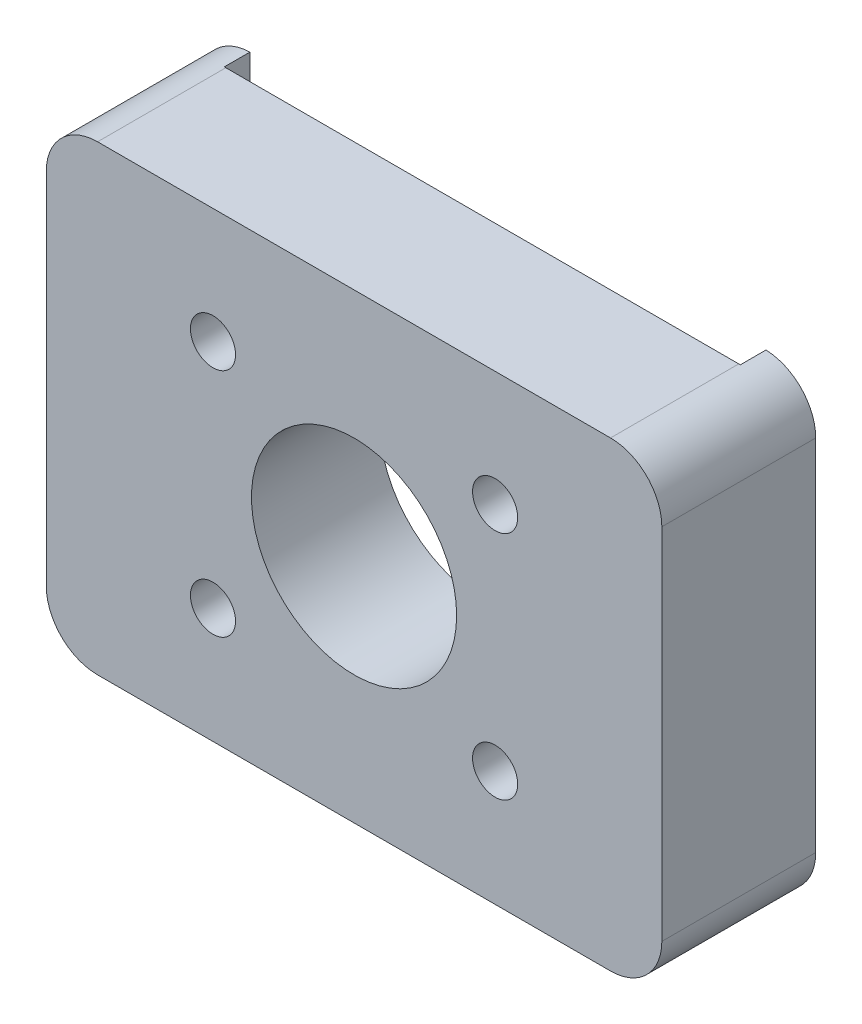
ISO-10303-21;
HEADER;
FILE_DESCRIPTION(('STEP AP214'),'2;1');
FILE_NAME('part.step','',(''),(''),'','','');
FILE_SCHEMA(('AUTOMOTIVE_DESIGN { 1 0 10303 214 1 1 1 1 }'));
ENDSEC;
DATA;
#1=APPLICATION_CONTEXT('core data for automotive mechanical design processes');
#2=APPLICATION_PROTOCOL_DEFINITION('international standard','automotive_design',2000,#1);
#3=PRODUCT_CONTEXT('',#1,'mechanical');
#4=PRODUCT('Part','Part','',(#3));
#5=PRODUCT_RELATED_PRODUCT_CATEGORY('part','',(#4));
#6=PRODUCT_DEFINITION_FORMATION('','',#4);
#7=PRODUCT_DEFINITION_CONTEXT('part definition',#1,'design');
#8=PRODUCT_DEFINITION('design','',#6,#7);
#9=PRODUCT_DEFINITION_SHAPE('','',#8);
#10=(LENGTH_UNIT() NAMED_UNIT(*) SI_UNIT(.MILLI.,.METRE.));
#11=(NAMED_UNIT(*) PLANE_ANGLE_UNIT() SI_UNIT($,.RADIAN.));
#12=(NAMED_UNIT(*) SI_UNIT($,.STERADIAN.) SOLID_ANGLE_UNIT());
#13=UNCERTAINTY_MEASURE_WITH_UNIT(LENGTH_MEASURE(1.E-05),#10,'distance_accuracy_value','');
#14=(GEOMETRIC_REPRESENTATION_CONTEXT(3) GLOBAL_UNCERTAINTY_ASSIGNED_CONTEXT((#13)) GLOBAL_UNIT_ASSIGNED_CONTEXT((#10,
#11,#12)) REPRESENTATION_CONTEXT('',''));
#15=CARTESIAN_POINT('',(0.,0.,0.));
#16=DIRECTION('',(0.,0.,1.));
#17=DIRECTION('',(1.,0.,0.));
#18=AXIS2_PLACEMENT_3D('',#15,#16,#17);
#19=CARTESIAN_POINT('',(-50.,-35.,0.));
#20=DIRECTION('',(0.,0.,1.));
#21=DIRECTION('',(1.,0.,0.));
#22=AXIS2_PLACEMENT_3D('',#19,#20,#21);
#23=PLANE('',#22);
#24=CARTESIAN_POINT('',(-27.5,22.5,0.));
#25=DIRECTION('',(0.,0.,1.));
#26=DIRECTION('',(1.,0.,0.));
#27=AXIS2_PLACEMENT_3D('',#24,#25,#26);
#28=CIRCLE('',#27,4.4);
#29=CARTESIAN_POINT('',(-23.1,22.5,0.));
#30=VERTEX_POINT('',#29);
#31=EDGE_CURVE('E243',#30,#30,#28,.T.);
#32=ORIENTED_EDGE('',*,*,#31,.T.);
#33=EDGE_LOOP('',(#32));
#34=FACE_BOUND('',#33,.T.);
#35=CARTESIAN_POINT('',(27.5,22.5,0.));
#36=DIRECTION('',(0.,0.,1.));
#37=DIRECTION('',(1.,0.,0.));
#38=AXIS2_PLACEMENT_3D('',#35,#36,#37);
#39=CIRCLE('',#38,4.4);
#40=CARTESIAN_POINT('',(31.9,22.5,0.));
#41=VERTEX_POINT('',#40);
#42=EDGE_CURVE('E237',#41,#41,#39,.T.);
#43=ORIENTED_EDGE('',*,*,#42,.T.);
#44=EDGE_LOOP('',(#43));
#45=FACE_BOUND('',#44,.T.);
#46=CARTESIAN_POINT('',(-27.5,-22.5,0.));
#47=DIRECTION('',(0.,0.,1.));
#48=DIRECTION('',(1.,0.,0.));
#49=AXIS2_PLACEMENT_3D('',#46,#47,#48);
#50=CIRCLE('',#49,4.4);
#51=CARTESIAN_POINT('',(-23.1,-22.5,0.));
#52=VERTEX_POINT('',#51);
#53=EDGE_CURVE('E231',#52,#52,#50,.T.);
#54=ORIENTED_EDGE('',*,*,#53,.T.);
#55=EDGE_LOOP('',(#54));
#56=FACE_BOUND('',#55,.T.);
#57=CARTESIAN_POINT('',(27.5,-22.5,0.));
#58=DIRECTION('',(0.,0.,1.));
#59=DIRECTION('',(1.,0.,0.));
#60=AXIS2_PLACEMENT_3D('',#57,#58,#59);
#61=CIRCLE('',#60,4.4);
#62=CARTESIAN_POINT('',(31.9,-22.5,0.));
#63=VERTEX_POINT('',#62);
#64=EDGE_CURVE('E225',#63,#63,#61,.T.);
#65=ORIENTED_EDGE('',*,*,#64,.T.);
#66=EDGE_LOOP('',(#65));
#67=FACE_BOUND('',#66,.T.);
#68=CARTESIAN_POINT('',(0.,0.,0.));
#69=DIRECTION('',(0.,0.,1.));
#70=DIRECTION('',(1.,0.,0.));
#71=AXIS2_PLACEMENT_3D('',#68,#69,#70);
#72=CIRCLE('',#71,20.);
#73=CARTESIAN_POINT('',(20.,0.,0.));
#74=VERTEX_POINT('',#73);
#75=EDGE_CURVE('E221',#74,#74,#72,.T.);
#76=ORIENTED_EDGE('',*,*,#75,.T.);
#77=EDGE_LOOP('',(#76));
#78=FACE_BOUND('',#77,.T.);
#79=DIRECTION('',(0.,-1.,0.));
#80=VECTOR('',#79,1.);
#81=CARTESIAN_POINT('',(-50.3,44.9954989870441,0.));
#82=LINE('',#81,#80);
#83=CARTESIAN_POINT('',(-50.3,44.9954989870441,0.));
#84=VERTEX_POINT('',#83);
#85=CARTESIAN_POINT('',(-50.3,-44.9954989870441,0.));
#86=VERTEX_POINT('',#85);
#87=EDGE_CURVE('E195',#84,#86,#82,.T.);
#88=ORIENTED_EDGE('',*,*,#87,.F.);
#89=CARTESIAN_POINT('',(-50.,35.,0.));
#90=DIRECTION('',(0.,0.,1.));
#91=DIRECTION('',(1.,0.,0.));
#92=AXIS2_PLACEMENT_3D('',#89,#90,#91);
#93=CIRCLE('',#92,10.);
#94=CARTESIAN_POINT('',(-49.9999999999999,45.,0.));
#95=VERTEX_POINT('',#94);
#96=EDGE_CURVE('E145',#95,#84,#93,.T.);
#97=ORIENTED_EDGE('',*,*,#96,.F.);
#98=DIRECTION('',(-1.,0.,0.));
#99=VECTOR('',#98,1.);
#100=CARTESIAN_POINT('',(-49.9999999999999,45.,0.));
#101=LINE('',#100,#99);
#102=CARTESIAN_POINT('',(49.9999999999999,45.,0.));
#103=VERTEX_POINT('',#102);
#104=EDGE_CURVE('E85',#103,#95,#101,.T.);
#105=ORIENTED_EDGE('',*,*,#104,.F.);
#106=CARTESIAN_POINT('',(50.,35.,0.));
#107=DIRECTION('',(0.,0.,1.));
#108=DIRECTION('',(1.,0.,0.));
#109=AXIS2_PLACEMENT_3D('',#106,#107,#108);
#110=CIRCLE('',#109,10.);
#111=CARTESIAN_POINT('',(50.3,44.9954989870441,0.));
#112=VERTEX_POINT('',#111);
#113=EDGE_CURVE('E142',#112,#103,#110,.T.);
#114=ORIENTED_EDGE('',*,*,#113,.F.);
#115=DIRECTION('',(0.,1.,0.));
#116=VECTOR('',#115,1.);
#117=CARTESIAN_POINT('',(50.3,44.9954989870441,0.));
#118=LINE('',#117,#116);
#119=CARTESIAN_POINT('',(50.3,-44.9954989870441,0.));
#120=VERTEX_POINT('',#119);
#121=EDGE_CURVE('E54',#120,#112,#118,.T.);
#122=ORIENTED_EDGE('',*,*,#121,.F.);
#123=CARTESIAN_POINT('',(50.,-35.,0.));
#124=DIRECTION('',(0.,0.,1.));
#125=DIRECTION('',(1.,0.,0.));
#126=AXIS2_PLACEMENT_3D('',#123,#124,#125);
#127=CIRCLE('',#126,10.);
#128=CARTESIAN_POINT('',(49.9999999999999,-45.,0.));
#129=VERTEX_POINT('',#128);
#130=EDGE_CURVE('E140',#129,#120,#127,.T.);
#131=ORIENTED_EDGE('',*,*,#130,.F.);
#132=DIRECTION('',(1.,0.,0.));
#133=VECTOR('',#132,1.);
#134=CARTESIAN_POINT('',(-49.9999999999999,-45.,0.));
#135=LINE('',#134,#133);
#136=CARTESIAN_POINT('',(-49.9999999999999,-45.,0.));
#137=VERTEX_POINT('',#136);
#138=EDGE_CURVE('E137',#137,#129,#135,.T.);
#139=ORIENTED_EDGE('',*,*,#138,.F.);
#140=CARTESIAN_POINT('',(-50.,-35.,0.));
#141=DIRECTION('',(0.,0.,1.));
#142=DIRECTION('',(1.,0.,0.));
#143=AXIS2_PLACEMENT_3D('',#140,#141,#142);
#144=CIRCLE('',#143,9.99999999999999);
#145=EDGE_CURVE('E135',#86,#137,#144,.T.);
#146=ORIENTED_EDGE('',*,*,#145,.F.);
#147=EDGE_LOOP('',(#88,#97,#105,#114,#122,#131,#139,#146));
#148=FACE_BOUND('',#147,.T.);
#149=ADVANCED_FACE('F39',(#34,#45,#56,#67,#78,#148),#23,.F.);
#150=CARTESIAN_POINT('',(-50.,-35.,25.));
#151=DIRECTION('',(0.,0.,1.));
#152=DIRECTION('',(1.,0.,0.));
#153=AXIS2_PLACEMENT_3D('',#150,#151,#152);
#154=PLANE('',#153);
#155=CARTESIAN_POINT('',(27.5,-22.5,25.));
#156=DIRECTION('',(0.,0.,1.));
#157=DIRECTION('',(1.,0.,0.));
#158=AXIS2_PLACEMENT_3D('',#155,#156,#157);
#159=CIRCLE('',#158,4.4);
#160=CARTESIAN_POINT('',(31.9,-22.5,25.));
#161=VERTEX_POINT('',#160);
#162=EDGE_CURVE('E228',#161,#161,#159,.T.);
#163=ORIENTED_EDGE('',*,*,#162,.F.);
#164=EDGE_LOOP('',(#163));
#165=FACE_BOUND('',#164,.T.);
#166=CARTESIAN_POINT('',(27.5,22.5,25.));
#167=DIRECTION('',(0.,0.,1.));
#168=DIRECTION('',(1.,0.,0.));
#169=AXIS2_PLACEMENT_3D('',#166,#167,#168);
#170=CIRCLE('',#169,4.4);
#171=CARTESIAN_POINT('',(31.9,22.5,25.));
#172=VERTEX_POINT('',#171);
#173=EDGE_CURVE('E240',#172,#172,#170,.T.);
#174=ORIENTED_EDGE('',*,*,#173,.F.);
#175=EDGE_LOOP('',(#174));
#176=FACE_BOUND('',#175,.T.);
#177=CARTESIAN_POINT('',(-50.,-35.,25.));
#178=DIRECTION('',(0.,0.,1.));
#179=DIRECTION('',(1.,0.,0.));
#180=AXIS2_PLACEMENT_3D('',#177,#178,#179);
#181=CIRCLE('',#180,9.99999999999999);
#182=CARTESIAN_POINT('',(-60.,-34.9999999999999,25.));
#183=VERTEX_POINT('',#182);
#184=CARTESIAN_POINT('',(-49.9999999999999,-45.,25.));
#185=VERTEX_POINT('',#184);
#186=EDGE_CURVE('E147',#183,#185,#181,.T.);
#187=ORIENTED_EDGE('',*,*,#186,.T.);
#188=DIRECTION('',(1.,0.,0.));
#189=VECTOR('',#188,1.);
#190=CARTESIAN_POINT('',(-49.9999999999999,-45.,25.));
#191=LINE('',#190,#189);
#192=CARTESIAN_POINT('',(49.9999999999999,-45.,25.));
#193=VERTEX_POINT('',#192);
#194=EDGE_CURVE('E93',#185,#193,#191,.T.);
#195=ORIENTED_EDGE('',*,*,#194,.T.);
#196=CARTESIAN_POINT('',(50.,-35.,25.));
#197=DIRECTION('',(0.,0.,1.));
#198=DIRECTION('',(1.,0.,0.));
#199=AXIS2_PLACEMENT_3D('',#196,#197,#198);
#200=CIRCLE('',#199,10.);
#201=CARTESIAN_POINT('',(60.,-34.9999999999999,25.));
#202=VERTEX_POINT('',#201);
#203=EDGE_CURVE('E164',#193,#202,#200,.T.);
#204=ORIENTED_EDGE('',*,*,#203,.T.);
#205=DIRECTION('',(0.,1.,0.));
#206=VECTOR('',#205,1.);
#207=CARTESIAN_POINT('',(60.,34.9999999999999,25.));
#208=LINE('',#207,#206);
#209=CARTESIAN_POINT('',(60.,34.9999999999999,25.));
#210=VERTEX_POINT('',#209);
#211=EDGE_CURVE('E253',#202,#210,#208,.T.);
#212=ORIENTED_EDGE('',*,*,#211,.T.);
#213=CARTESIAN_POINT('',(50.,35.,25.));
#214=DIRECTION('',(0.,0.,1.));
#215=DIRECTION('',(1.,0.,0.));
#216=AXIS2_PLACEMENT_3D('',#213,#214,#215);
#217=CIRCLE('',#216,10.);
#218=CARTESIAN_POINT('',(49.9999999999999,45.,25.));
#219=VERTEX_POINT('',#218);
#220=EDGE_CURVE('E116',#210,#219,#217,.T.);
#221=ORIENTED_EDGE('',*,*,#220,.T.);
#222=DIRECTION('',(-1.,0.,0.));
#223=VECTOR('',#222,1.);
#224=CARTESIAN_POINT('',(-49.9999999999999,45.,25.));
#225=LINE('',#224,#223);
#226=CARTESIAN_POINT('',(-49.9999999999999,45.,25.));
#227=VERTEX_POINT('',#226);
#228=EDGE_CURVE('E109',#219,#227,#225,.T.);
#229=ORIENTED_EDGE('',*,*,#228,.T.);
#230=CARTESIAN_POINT('',(-50.,35.,25.));
#231=DIRECTION('',(0.,0.,1.));
#232=DIRECTION('',(1.,0.,0.));
#233=AXIS2_PLACEMENT_3D('',#230,#231,#232);
#234=CIRCLE('',#233,10.);
#235=CARTESIAN_POINT('',(-60.,34.9999999999999,25.));
#236=VERTEX_POINT('',#235);
#237=EDGE_CURVE('E113',#227,#236,#234,.T.);
#238=ORIENTED_EDGE('',*,*,#237,.T.);
#239=DIRECTION('',(0.,-1.,0.));
#240=VECTOR('',#239,1.);
#241=CARTESIAN_POINT('',(-60.,34.9999999999999,25.));
#242=LINE('',#241,#240);
#243=EDGE_CURVE('E63',#236,#183,#242,.T.);
#244=ORIENTED_EDGE('',*,*,#243,.T.);
#245=EDGE_LOOP('',(#187,#195,#204,#212,#221,#229,#238,#244));
#246=FACE_BOUND('',#245,.T.);
#247=CARTESIAN_POINT('',(-27.5,22.5,25.));
#248=DIRECTION('',(0.,0.,1.));
#249=DIRECTION('',(1.,0.,0.));
#250=AXIS2_PLACEMENT_3D('',#247,#248,#249);
#251=CIRCLE('',#250,4.4);
#252=CARTESIAN_POINT('',(-23.1,22.5,25.));
#253=VERTEX_POINT('',#252);
#254=EDGE_CURVE('E138',#253,#253,#251,.T.);
#255=ORIENTED_EDGE('',*,*,#254,.F.);
#256=EDGE_LOOP('',(#255));
#257=FACE_BOUND('',#256,.T.);
#258=CARTESIAN_POINT('',(-27.5,-22.5,25.));
#259=DIRECTION('',(0.,0.,1.));
#260=DIRECTION('',(1.,0.,0.));
#261=AXIS2_PLACEMENT_3D('',#258,#259,#260);
#262=CIRCLE('',#261,4.4);
#263=CARTESIAN_POINT('',(-23.1,-22.5,25.));
#264=VERTEX_POINT('',#263);
#265=EDGE_CURVE('E234',#264,#264,#262,.T.);
#266=ORIENTED_EDGE('',*,*,#265,.F.);
#267=EDGE_LOOP('',(#266));
#268=FACE_BOUND('',#267,.T.);
#269=CARTESIAN_POINT('',(0.,0.,25.));
#270=DIRECTION('',(0.,0.,1.));
#271=DIRECTION('',(1.,0.,0.));
#272=AXIS2_PLACEMENT_3D('',#269,#270,#271);
#273=CIRCLE('',#272,20.);
#274=CARTESIAN_POINT('',(20.,0.,25.));
#275=VERTEX_POINT('',#274);
#276=EDGE_CURVE('E222',#275,#275,#273,.T.);
#277=ORIENTED_EDGE('',*,*,#276,.F.);
#278=EDGE_LOOP('',(#277));
#279=FACE_BOUND('',#278,.T.);
#280=ADVANCED_FACE('F110',(#165,#176,#246,#257,#268,#279),#154,.T.);
#281=CARTESIAN_POINT('',(-50.,-35.,25.));
#282=DIRECTION('',(0.,0.,-1.));
#283=DIRECTION('',(-1.,0.,0.));
#284=AXIS2_PLACEMENT_3D('',#281,#282,#283);
#285=CYLINDRICAL_SURFACE('',#284,9.99999999999999);
#286=DIRECTION('',(0.,0.,-1.));
#287=VECTOR('',#286,1.);
#288=CARTESIAN_POINT('',(-60.,-34.9999999999999,25.));
#289=LINE('',#288,#287);
#290=CARTESIAN_POINT('',(-60.,-34.9999999999999,-5.));
#291=VERTEX_POINT('',#290);
#292=EDGE_CURVE('E131',#183,#291,#289,.T.);
#293=ORIENTED_EDGE('',*,*,#292,.T.);
#294=CARTESIAN_POINT('',(-50.,-35.,-5.));
#295=DIRECTION('',(0.,0.,-1.));
#296=DIRECTION('',(-1.,0.,0.));
#297=AXIS2_PLACEMENT_3D('',#294,#295,#296);
#298=CIRCLE('',#297,10.);
#299=CARTESIAN_POINT('',(-50.3,-44.9954989870441,-5.));
#300=VERTEX_POINT('',#299);
#301=EDGE_CURVE('E179',#300,#291,#298,.T.);
#302=ORIENTED_EDGE('',*,*,#301,.F.);
#303=DIRECTION('',(0.,0.,1.));
#304=VECTOR('',#303,1.);
#305=CARTESIAN_POINT('',(-50.3,-44.9954989870441,-5.));
#306=LINE('',#305,#304);
#307=EDGE_CURVE('E176',#300,#86,#306,.T.);
#308=ORIENTED_EDGE('',*,*,#307,.T.);
#309=ORIENTED_EDGE('',*,*,#145,.T.);
#310=DIRECTION('',(0.,0.,-1.));
#311=VECTOR('',#310,1.);
#312=CARTESIAN_POINT('',(-49.9999999999999,-45.,25.));
#313=LINE('',#312,#311);
#314=EDGE_CURVE('E11',#185,#137,#313,.T.);
#315=ORIENTED_EDGE('',*,*,#314,.F.);
#316=ORIENTED_EDGE('',*,*,#186,.F.);
#317=EDGE_LOOP('',(#293,#302,#308,#309,#315,#316));
#318=FACE_BOUND('',#317,.T.);
#319=ADVANCED_FACE('F41',(#318),#285,.T.);
#320=CARTESIAN_POINT('',(-49.9999999999999,-45.,25.));
#321=DIRECTION('',(0.,1.,0.));
#322=DIRECTION('',(0.,0.,1.));
#323=AXIS2_PLACEMENT_3D('',#320,#321,#322);
#324=PLANE('',#323);
#325=ORIENTED_EDGE('',*,*,#138,.T.);
#326=DIRECTION('',(0.,0.,-1.));
#327=VECTOR('',#326,1.);
#328=CARTESIAN_POINT('',(49.9999999999999,-45.,25.));
#329=LINE('',#328,#327);
#330=EDGE_CURVE('E47',#193,#129,#329,.T.);
#331=ORIENTED_EDGE('',*,*,#330,.F.);
#332=ORIENTED_EDGE('',*,*,#194,.F.);
#333=ORIENTED_EDGE('',*,*,#314,.T.);
#334=EDGE_LOOP('',(#325,#331,#332,#333));
#335=FACE_BOUND('',#334,.T.);
#336=ADVANCED_FACE('F170',(#335),#324,.F.);
#337=CARTESIAN_POINT('',(50.,-35.,25.));
#338=DIRECTION('',(0.,0.,-1.));
#339=DIRECTION('',(-1.,0.,0.));
#340=AXIS2_PLACEMENT_3D('',#337,#338,#339);
#341=CYLINDRICAL_SURFACE('',#340,10.);
#342=ORIENTED_EDGE('',*,*,#130,.T.);
#343=DIRECTION('',(0.,0.,1.));
#344=VECTOR('',#343,1.);
#345=CARTESIAN_POINT('',(50.3,-44.9954989870441,-5.));
#346=LINE('',#345,#344);
#347=CARTESIAN_POINT('',(50.3,-44.9954989870441,-5.));
#348=VERTEX_POINT('',#347);
#349=EDGE_CURVE('E219',#348,#120,#346,.T.);
#350=ORIENTED_EDGE('',*,*,#349,.F.);
#351=CARTESIAN_POINT('',(50.,-35.,-5.));
#352=DIRECTION('',(0.,0.,-1.));
#353=DIRECTION('',(1.,0.,0.));
#354=AXIS2_PLACEMENT_3D('',#351,#352,#353);
#355=CIRCLE('',#354,10.);
#356=CARTESIAN_POINT('',(60.,-35.,-5.));
#357=VERTEX_POINT('',#356);
#358=EDGE_CURVE('E209',#357,#348,#355,.T.);
#359=ORIENTED_EDGE('',*,*,#358,.F.);
#360=DIRECTION('',(0.,0.,-1.));
#361=VECTOR('',#360,1.);
#362=CARTESIAN_POINT('',(60.,-34.9999999999999,25.));
#363=LINE('',#362,#361);
#364=EDGE_CURVE('E155',#202,#357,#363,.T.);
#365=ORIENTED_EDGE('',*,*,#364,.F.);
#366=ORIENTED_EDGE('',*,*,#203,.F.);
#367=ORIENTED_EDGE('',*,*,#330,.T.);
#368=EDGE_LOOP('',(#342,#350,#359,#365,#366,#367));
#369=FACE_BOUND('',#368,.T.);
#370=ADVANCED_FACE('F160',(#369),#341,.T.);
#371=CARTESIAN_POINT('',(60.,34.9999999999999,25.));
#372=DIRECTION('',(-1.,0.,0.));
#373=DIRECTION('',(0.,-1.,0.));
#374=AXIS2_PLACEMENT_3D('',#371,#372,#373);
#375=PLANE('',#374);
#376=ORIENTED_EDGE('',*,*,#364,.T.);
#377=DIRECTION('',(0.,-1.,0.));
#378=VECTOR('',#377,1.);
#379=CARTESIAN_POINT('',(60.,-34.9999999999999,-5.));
#380=LINE('',#379,#378);
#381=CARTESIAN_POINT('',(60.,34.9999999999999,-5.));
#382=VERTEX_POINT('',#381);
#383=EDGE_CURVE('E206',#382,#357,#380,.T.);
#384=ORIENTED_EDGE('',*,*,#383,.F.);
#385=DIRECTION('',(0.,0.,-1.));
#386=VECTOR('',#385,1.);
#387=CARTESIAN_POINT('',(60.,34.9999999999999,25.));
#388=LINE('',#387,#386);
#389=EDGE_CURVE('E152',#210,#382,#388,.T.);
#390=ORIENTED_EDGE('',*,*,#389,.F.);
#391=ORIENTED_EDGE('',*,*,#211,.F.);
#392=EDGE_LOOP('',(#376,#384,#390,#391));
#393=FACE_BOUND('',#392,.T.);
#394=ADVANCED_FACE('F258',(#393),#375,.F.);
#395=CARTESIAN_POINT('',(50.,35.,25.));
#396=DIRECTION('',(0.,0.,-1.));
#397=DIRECTION('',(-1.,0.,0.));
#398=AXIS2_PLACEMENT_3D('',#395,#396,#397);
#399=CYLINDRICAL_SURFACE('',#398,10.);
#400=ORIENTED_EDGE('',*,*,#389,.T.);
#401=CARTESIAN_POINT('',(50.,35.,-5.));
#402=DIRECTION('',(0.,0.,-1.));
#403=DIRECTION('',(-1.,0.,0.));
#404=AXIS2_PLACEMENT_3D('',#401,#402,#403);
#405=CIRCLE('',#404,9.99999999999999);
#406=CARTESIAN_POINT('',(50.3,44.9954989870441,-5.));
#407=VERTEX_POINT('',#406);
#408=EDGE_CURVE('E203',#407,#382,#405,.T.);
#409=ORIENTED_EDGE('',*,*,#408,.F.);
#410=DIRECTION('',(0.,0.,1.));
#411=VECTOR('',#410,1.);
#412=CARTESIAN_POINT('',(50.3,44.9954989870441,-5.));
#413=LINE('',#412,#411);
#414=EDGE_CURVE('E215',#407,#112,#413,.T.);
#415=ORIENTED_EDGE('',*,*,#414,.T.);
#416=ORIENTED_EDGE('',*,*,#113,.T.);
#417=DIRECTION('',(0.,0.,-1.));
#418=VECTOR('',#417,1.);
#419=CARTESIAN_POINT('',(49.9999999999999,45.,25.));
#420=LINE('',#419,#418);
#421=EDGE_CURVE('E124',#219,#103,#420,.T.);
#422=ORIENTED_EDGE('',*,*,#421,.F.);
#423=ORIENTED_EDGE('',*,*,#220,.F.);
#424=EDGE_LOOP('',(#400,#409,#415,#416,#422,#423));
#425=FACE_BOUND('',#424,.T.);
#426=ADVANCED_FACE('F262',(#425),#399,.T.);
#427=CARTESIAN_POINT('',(-49.9999999999999,45.,25.));
#428=DIRECTION('',(0.,-1.,0.));
#429=DIRECTION('',(0.,0.,-1.));
#430=AXIS2_PLACEMENT_3D('',#427,#428,#429);
#431=PLANE('',#430);
#432=ORIENTED_EDGE('',*,*,#104,.T.);
#433=DIRECTION('',(0.,0.,-1.));
#434=VECTOR('',#433,1.);
#435=CARTESIAN_POINT('',(-49.9999999999999,45.,25.));
#436=LINE('',#435,#434);
#437=EDGE_CURVE('E119',#227,#95,#436,.T.);
#438=ORIENTED_EDGE('',*,*,#437,.F.);
#439=ORIENTED_EDGE('',*,*,#228,.F.);
#440=ORIENTED_EDGE('',*,*,#421,.T.);
#441=EDGE_LOOP('',(#432,#438,#439,#440));
#442=FACE_BOUND('',#441,.T.);
#443=ADVANCED_FACE('F120',(#442),#431,.F.);
#444=CARTESIAN_POINT('',(-50.,35.,25.));
#445=DIRECTION('',(0.,0.,-1.));
#446=DIRECTION('',(-1.,0.,0.));
#447=AXIS2_PLACEMENT_3D('',#444,#445,#446);
#448=CYLINDRICAL_SURFACE('',#447,10.);
#449=ORIENTED_EDGE('',*,*,#96,.T.);
#450=DIRECTION('',(0.,0.,1.));
#451=VECTOR('',#450,1.);
#452=CARTESIAN_POINT('',(-50.3,44.9954989870441,-5.));
#453=LINE('',#452,#451);
#454=CARTESIAN_POINT('',(-50.3,44.9954989870441,-5.));
#455=VERTEX_POINT('',#454);
#456=EDGE_CURVE('E187',#455,#84,#453,.T.);
#457=ORIENTED_EDGE('',*,*,#456,.F.);
#458=CARTESIAN_POINT('',(-50.,35.,-5.));
#459=DIRECTION('',(0.,0.,-1.));
#460=DIRECTION('',(-1.,0.,0.));
#461=AXIS2_PLACEMENT_3D('',#458,#459,#460);
#462=CIRCLE('',#461,9.99999999999999);
#463=CARTESIAN_POINT('',(-60.,34.9999999999999,-5.));
#464=VERTEX_POINT('',#463);
#465=EDGE_CURVE('E190',#464,#455,#462,.T.);
#466=ORIENTED_EDGE('',*,*,#465,.F.);
#467=DIRECTION('',(0.,0.,-1.));
#468=VECTOR('',#467,1.);
#469=CARTESIAN_POINT('',(-60.,34.9999999999999,25.));
#470=LINE('',#469,#468);
#471=EDGE_CURVE('E125',#236,#464,#470,.T.);
#472=ORIENTED_EDGE('',*,*,#471,.F.);
#473=ORIENTED_EDGE('',*,*,#237,.F.);
#474=ORIENTED_EDGE('',*,*,#437,.T.);
#475=EDGE_LOOP('',(#449,#457,#466,#472,#473,#474));
#476=FACE_BOUND('',#475,.T.);
#477=ADVANCED_FACE('F127',(#476),#448,.T.);
#478=CARTESIAN_POINT('',(-60.,34.9999999999999,25.));
#479=DIRECTION('',(1.,0.,0.));
#480=DIRECTION('',(0.,1.,0.));
#481=AXIS2_PLACEMENT_3D('',#478,#479,#480);
#482=PLANE('',#481);
#483=ORIENTED_EDGE('',*,*,#471,.T.);
#484=DIRECTION('',(0.,1.,0.));
#485=VECTOR('',#484,1.);
#486=CARTESIAN_POINT('',(-60.,-34.9999999999999,-5.));
#487=LINE('',#486,#485);
#488=EDGE_CURVE('E199',#291,#464,#487,.T.);
#489=ORIENTED_EDGE('',*,*,#488,.F.);
#490=ORIENTED_EDGE('',*,*,#292,.F.);
#491=ORIENTED_EDGE('',*,*,#243,.F.);
#492=EDGE_LOOP('',(#483,#489,#490,#491));
#493=FACE_BOUND('',#492,.T.);
#494=ADVANCED_FACE('F308',(#493),#482,.F.);
#495=CARTESIAN_POINT('',(-27.5,22.5,25.));
#496=DIRECTION('',(0.,0.,-1.));
#497=DIRECTION('',(-1.,0.,0.));
#498=AXIS2_PLACEMENT_3D('',#495,#496,#497);
#499=CYLINDRICAL_SURFACE('',#498,4.4);
#500=ORIENTED_EDGE('',*,*,#254,.T.);
#501=EDGE_LOOP('',(#500));
#502=FACE_BOUND('',#501,.T.);
#503=ORIENTED_EDGE('',*,*,#31,.F.);
#504=EDGE_LOOP('',(#503));
#505=FACE_BOUND('',#504,.T.);
#506=ADVANCED_FACE('F310',(#502,#505),#499,.F.);
#507=CARTESIAN_POINT('',(27.5,22.5,25.));
#508=DIRECTION('',(0.,0.,-1.));
#509=DIRECTION('',(-1.,0.,0.));
#510=AXIS2_PLACEMENT_3D('',#507,#508,#509);
#511=CYLINDRICAL_SURFACE('',#510,4.4);
#512=ORIENTED_EDGE('',*,*,#173,.T.);
#513=EDGE_LOOP('',(#512));
#514=FACE_BOUND('',#513,.T.);
#515=ORIENTED_EDGE('',*,*,#42,.F.);
#516=EDGE_LOOP('',(#515));
#517=FACE_BOUND('',#516,.T.);
#518=ADVANCED_FACE('F410',(#514,#517),#511,.F.);
#519=CARTESIAN_POINT('',(-27.5,-22.5,25.));
#520=DIRECTION('',(0.,0.,-1.));
#521=DIRECTION('',(-1.,0.,0.));
#522=AXIS2_PLACEMENT_3D('',#519,#520,#521);
#523=CYLINDRICAL_SURFACE('',#522,4.4);
#524=ORIENTED_EDGE('',*,*,#265,.T.);
#525=EDGE_LOOP('',(#524));
#526=FACE_BOUND('',#525,.T.);
#527=ORIENTED_EDGE('',*,*,#53,.F.);
#528=EDGE_LOOP('',(#527));
#529=FACE_BOUND('',#528,.T.);
#530=ADVANCED_FACE('F401',(#526,#529),#523,.F.);
#531=CARTESIAN_POINT('',(27.5,-22.5,25.));
#532=DIRECTION('',(0.,0.,-1.));
#533=DIRECTION('',(-1.,0.,0.));
#534=AXIS2_PLACEMENT_3D('',#531,#532,#533);
#535=CYLINDRICAL_SURFACE('',#534,4.4);
#536=ORIENTED_EDGE('',*,*,#162,.T.);
#537=EDGE_LOOP('',(#536));
#538=FACE_BOUND('',#537,.T.);
#539=ORIENTED_EDGE('',*,*,#64,.F.);
#540=EDGE_LOOP('',(#539));
#541=FACE_BOUND('',#540,.T.);
#542=ADVANCED_FACE('F293',(#538,#541),#535,.F.);
#543=CARTESIAN_POINT('',(0.,0.,25.));
#544=DIRECTION('',(0.,0.,-1.));
#545=DIRECTION('',(-1.,0.,0.));
#546=AXIS2_PLACEMENT_3D('',#543,#544,#545);
#547=CYLINDRICAL_SURFACE('',#546,20.);
#548=ORIENTED_EDGE('',*,*,#276,.T.);
#549=EDGE_LOOP('',(#548));
#550=FACE_BOUND('',#549,.T.);
#551=ORIENTED_EDGE('',*,*,#75,.F.);
#552=EDGE_LOOP('',(#551));
#553=FACE_BOUND('',#552,.T.);
#554=ADVANCED_FACE('F284',(#550,#553),#547,.F.);
#555=CARTESIAN_POINT('',(50.3,44.9954989870441,-5.));
#556=DIRECTION('',(1.,0.,0.));
#557=DIRECTION('',(0.,1.,0.));
#558=AXIS2_PLACEMENT_3D('',#555,#556,#557);
#559=PLANE('',#558);
#560=ORIENTED_EDGE('',*,*,#121,.T.);
#561=ORIENTED_EDGE('',*,*,#414,.F.);
#562=DIRECTION('',(0.,1.,0.));
#563=VECTOR('',#562,1.);
#564=CARTESIAN_POINT('',(50.3,44.9954989870441,-5.));
#565=LINE('',#564,#563);
#566=EDGE_CURVE('E212',#348,#407,#565,.T.);
#567=ORIENTED_EDGE('',*,*,#566,.F.);
#568=ORIENTED_EDGE('',*,*,#349,.T.);
#569=EDGE_LOOP('',(#560,#561,#567,#568));
#570=FACE_BOUND('',#569,.T.);
#571=ADVANCED_FACE('F282',(#570),#559,.F.);
#572=CARTESIAN_POINT('',(50.,35.,-5.));
#573=DIRECTION('',(0.,0.,-1.));
#574=DIRECTION('',(-1.,0.,0.));
#575=AXIS2_PLACEMENT_3D('',#572,#573,#574);
#576=PLANE('',#575);
#577=ORIENTED_EDGE('',*,*,#408,.T.);
#578=ORIENTED_EDGE('',*,*,#383,.T.);
#579=ORIENTED_EDGE('',*,*,#358,.T.);
#580=ORIENTED_EDGE('',*,*,#566,.T.);
#581=EDGE_LOOP('',(#577,#578,#579,#580));
#582=FACE_BOUND('',#581,.T.);
#583=ADVANCED_FACE('F279',(#582),#576,.T.);
#584=CARTESIAN_POINT('',(-50.3,44.9954989870441,-5.));
#585=DIRECTION('',(-1.,0.,0.));
#586=DIRECTION('',(0.,-1.,0.));
#587=AXIS2_PLACEMENT_3D('',#584,#585,#586);
#588=PLANE('',#587);
#589=ORIENTED_EDGE('',*,*,#87,.T.);
#590=ORIENTED_EDGE('',*,*,#307,.F.);
#591=DIRECTION('',(0.,-1.,0.));
#592=VECTOR('',#591,1.);
#593=CARTESIAN_POINT('',(-50.3,44.9954989870441,-5.));
#594=LINE('',#593,#592);
#595=EDGE_CURVE('E186',#455,#300,#594,.T.);
#596=ORIENTED_EDGE('',*,*,#595,.F.);
#597=ORIENTED_EDGE('',*,*,#456,.T.);
#598=EDGE_LOOP('',(#589,#590,#596,#597));
#599=FACE_BOUND('',#598,.T.);
#600=ADVANCED_FACE('F290',(#599),#588,.F.);
#601=CARTESIAN_POINT('',(-50.,-35.,-5.));
#602=DIRECTION('',(0.,0.,-1.));
#603=DIRECTION('',(-1.,0.,0.));
#604=AXIS2_PLACEMENT_3D('',#601,#602,#603);
#605=PLANE('',#604);
#606=ORIENTED_EDGE('',*,*,#301,.T.);
#607=ORIENTED_EDGE('',*,*,#488,.T.);
#608=ORIENTED_EDGE('',*,*,#465,.T.);
#609=ORIENTED_EDGE('',*,*,#595,.T.);
#610=EDGE_LOOP('',(#606,#607,#608,#609));
#611=FACE_BOUND('',#610,.T.);
#612=ADVANCED_FACE('F375',(#611),#605,.T.);
#613=CLOSED_SHELL('',(#149,#280,#319,#336,#370,#394,#426,#443,#477,#494,#506,#518,#530,#542,
#554,#571,#583,#600,#612));
#614=MANIFOLD_SOLID_BREP('B2',#613);
#615=ADVANCED_BREP_SHAPE_REPRESENTATION('',(#18,#614),#14);
#616=SHAPE_DEFINITION_REPRESENTATION(#9,#615);
ENDSEC;
END-ISO-10303-21;
